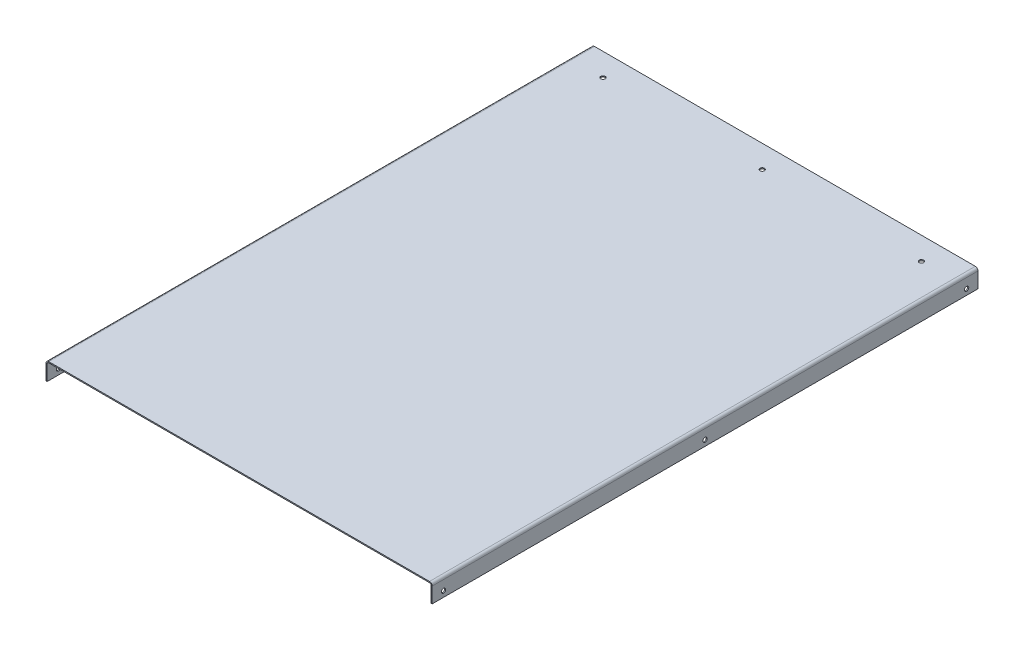
ISO-10303-21;
HEADER;
FILE_DESCRIPTION(('STEP AP214'),'2;1');
FILE_NAME('part.step','',(''),(''),'','','');
FILE_SCHEMA(('AUTOMOTIVE_DESIGN { 1 0 10303 214 1 1 1 1 }'));
ENDSEC;
DATA;
#1=APPLICATION_CONTEXT('core data for automotive mechanical design processes');
#2=APPLICATION_PROTOCOL_DEFINITION('international standard','automotive_design',2000,#1);
#3=PRODUCT_CONTEXT('',#1,'mechanical');
#4=PRODUCT('Part','Part','',(#3));
#5=PRODUCT_RELATED_PRODUCT_CATEGORY('part','',(#4));
#6=PRODUCT_DEFINITION_FORMATION('','',#4);
#7=PRODUCT_DEFINITION_CONTEXT('part definition',#1,'design');
#8=PRODUCT_DEFINITION('design','',#6,#7);
#9=PRODUCT_DEFINITION_SHAPE('','',#8);
#10=(LENGTH_UNIT() NAMED_UNIT(*) SI_UNIT(.MILLI.,.METRE.));
#11=(NAMED_UNIT(*) PLANE_ANGLE_UNIT() SI_UNIT($,.RADIAN.));
#12=(NAMED_UNIT(*) SI_UNIT($,.STERADIAN.) SOLID_ANGLE_UNIT());
#13=UNCERTAINTY_MEASURE_WITH_UNIT(LENGTH_MEASURE(1.E-05),#10,'distance_accuracy_value','');
#14=(GEOMETRIC_REPRESENTATION_CONTEXT(3) GLOBAL_UNCERTAINTY_ASSIGNED_CONTEXT((#13)) GLOBAL_UNIT_ASSIGNED_CONTEXT((#10,
#11,#12)) REPRESENTATION_CONTEXT('',''));
#15=CARTESIAN_POINT('',(0.,0.,0.));
#16=DIRECTION('',(0.,0.,1.));
#17=DIRECTION('',(1.,0.,0.));
#18=AXIS2_PLACEMENT_3D('',#15,#16,#17);
#19=CARTESIAN_POINT('',(1.778,19.05,-609.6));
#20=DIRECTION('',(0.,0.,-1.));
#21=DIRECTION('',(-1.,0.,0.));
#22=AXIS2_PLACEMENT_3D('',#19,#20,#21);
#23=PLANE('',#22);
#24=DIRECTION('',(0.,1.,0.));
#25=VECTOR('',#24,1.);
#26=CARTESIAN_POINT('',(1.778,19.05,-609.6));
#27=LINE('',#26,#25);
#28=CARTESIAN_POINT('',(1.778,19.05,-609.6));
#29=VERTEX_POINT('',#28);
#30=CARTESIAN_POINT('',(1.778,20.2692,-609.6));
#31=VERTEX_POINT('',#30);
#32=EDGE_CURVE('E11',#29,#31,#27,.T.);
#33=ORIENTED_EDGE('',*,*,#32,.F.);
#34=CARTESIAN_POINT('',(1.778,17.272,-609.6));
#35=DIRECTION('',(0.,0.,1.));
#36=DIRECTION('',(1.,0.,0.));
#37=AXIS2_PLACEMENT_3D('',#34,#35,#36);
#38=CIRCLE('',#37,1.778);
#39=CARTESIAN_POINT('',(0.,17.272,-609.6));
#40=VERTEX_POINT('',#39);
#41=EDGE_CURVE('E199',#40,#29,#38,.F.);
#42=ORIENTED_EDGE('',*,*,#41,.F.);
#43=DIRECTION('',(1.,0.,0.));
#44=VECTOR('',#43,1.);
#45=CARTESIAN_POINT('',(-1.2192,17.272,-609.6));
#46=LINE('',#45,#44);
#47=CARTESIAN_POINT('',(-1.2192,17.272,-609.6));
#48=VERTEX_POINT('',#47);
#49=EDGE_CURVE('E38',#48,#40,#46,.T.);
#50=ORIENTED_EDGE('',*,*,#49,.F.);
#51=CARTESIAN_POINT('',(1.778,17.272,-609.6));
#52=DIRECTION('',(0.,0.,1.));
#53=DIRECTION('',(1.,0.,0.));
#54=AXIS2_PLACEMENT_3D('',#51,#52,#53);
#55=CIRCLE('',#54,2.9972);
#56=EDGE_CURVE('E188',#48,#31,#55,.F.);
#57=ORIENTED_EDGE('',*,*,#56,.T.);
#58=EDGE_LOOP('',(#33,#42,#50,#57));
#59=FACE_BOUND('',#58,.T.);
#60=ADVANCED_FACE('F31',(#59),#23,.T.);
#61=CARTESIAN_POINT('',(-1.2192,17.272,-609.6));
#62=DIRECTION('',(0.,0.,-1.));
#63=DIRECTION('',(-1.,0.,0.));
#64=AXIS2_PLACEMENT_3D('',#61,#62,#63);
#65=PLANE('',#64);
#66=DIRECTION('',(1.,0.,0.));
#67=VECTOR('',#66,1.);
#68=CARTESIAN_POINT('',(0.,19.05,-609.6));
#69=LINE('',#68,#67);
#70=CARTESIAN_POINT('',(427.0756,19.05,-609.6));
#71=VERTEX_POINT('',#70);
#72=EDGE_CURVE('E202',#29,#71,#69,.T.);
#73=ORIENTED_EDGE('',*,*,#72,.F.);
#74=ORIENTED_EDGE('',*,*,#32,.T.);
#75=DIRECTION('',(1.,0.,0.));
#76=VECTOR('',#75,1.);
#77=CARTESIAN_POINT('',(0.,20.2692,-609.6));
#78=LINE('',#77,#76);
#79=CARTESIAN_POINT('',(427.0756,20.2692,-609.6));
#80=VERTEX_POINT('',#79);
#81=EDGE_CURVE('E186',#31,#80,#78,.T.);
#82=ORIENTED_EDGE('',*,*,#81,.T.);
#83=DIRECTION('',(1.36592399683213E-13,-1.,0.));
#84=VECTOR('',#83,1.);
#85=CARTESIAN_POINT('',(427.0756,20.2692,-609.6));
#86=LINE('',#85,#84);
#87=EDGE_CURVE('E53',#80,#71,#86,.T.);
#88=ORIENTED_EDGE('',*,*,#87,.T.);
#89=EDGE_LOOP('',(#73,#74,#82,#88));
#90=FACE_BOUND('',#89,.T.);
#91=ADVANCED_FACE('F278',(#90),#65,.T.);
#92=CARTESIAN_POINT('',(0.,17.272,0.));
#93=DIRECTION('',(0.,0.,1.));
#94=DIRECTION('',(1.,0.,0.));
#95=AXIS2_PLACEMENT_3D('',#92,#93,#94);
#96=PLANE('',#95);
#97=DIRECTION('',(-1.,0.,0.));
#98=VECTOR('',#97,1.);
#99=CARTESIAN_POINT('',(0.,17.272,0.));
#100=LINE('',#99,#98);
#101=CARTESIAN_POINT('',(0.,17.272,0.));
#102=VERTEX_POINT('',#101);
#103=CARTESIAN_POINT('',(-1.2192,17.272,0.));
#104=VERTEX_POINT('',#103);
#105=EDGE_CURVE('E243',#102,#104,#100,.T.);
#106=ORIENTED_EDGE('',*,*,#105,.F.);
#107=CARTESIAN_POINT('',(1.778,17.272,0.));
#108=DIRECTION('',(0.,0.,1.));
#109=DIRECTION('',(1.,0.,0.));
#110=AXIS2_PLACEMENT_3D('',#107,#108,#109);
#111=CIRCLE('',#110,1.778);
#112=CARTESIAN_POINT('',(1.778,19.05,0.));
#113=VERTEX_POINT('',#112);
#114=EDGE_CURVE('E171',#102,#113,#111,.F.);
#115=ORIENTED_EDGE('',*,*,#114,.T.);
#116=DIRECTION('',(0.,-1.,0.));
#117=VECTOR('',#116,1.);
#118=CARTESIAN_POINT('',(1.778,20.2692,0.));
#119=LINE('',#118,#117);
#120=CARTESIAN_POINT('',(1.778,20.2692,0.));
#121=VERTEX_POINT('',#120);
#122=EDGE_CURVE('E241',#121,#113,#119,.T.);
#123=ORIENTED_EDGE('',*,*,#122,.F.);
#124=CARTESIAN_POINT('',(1.778,17.272,0.));
#125=DIRECTION('',(0.,0.,1.));
#126=DIRECTION('',(1.,0.,0.));
#127=AXIS2_PLACEMENT_3D('',#124,#125,#126);
#128=CIRCLE('',#127,2.9972);
#129=EDGE_CURVE('E160',#104,#121,#128,.F.);
#130=ORIENTED_EDGE('',*,*,#129,.F.);
#131=EDGE_LOOP('',(#106,#115,#123,#130));
#132=FACE_BOUND('',#131,.T.);
#133=ADVANCED_FACE('F312',(#132),#96,.T.);
#134=CARTESIAN_POINT('',(1.778,20.2692,0.));
#135=DIRECTION('',(0.,0.,1.));
#136=DIRECTION('',(1.,0.,0.));
#137=AXIS2_PLACEMENT_3D('',#134,#135,#136);
#138=PLANE('',#137);
#139=DIRECTION('',(0.,1.,0.));
#140=VECTOR('',#139,1.);
#141=CARTESIAN_POINT('',(0.,0.,0.));
#142=LINE('',#141,#140);
#143=CARTESIAN_POINT('',(0.,0.,0.));
#144=VERTEX_POINT('',#143);
#145=EDGE_CURVE('E168',#144,#102,#142,.T.);
#146=ORIENTED_EDGE('',*,*,#145,.T.);
#147=ORIENTED_EDGE('',*,*,#105,.T.);
#148=DIRECTION('',(0.,1.,0.));
#149=VECTOR('',#148,1.);
#150=CARTESIAN_POINT('',(-1.2192,0.,0.));
#151=LINE('',#150,#149);
#152=CARTESIAN_POINT('',(-1.2192,0.,0.));
#153=VERTEX_POINT('',#152);
#154=EDGE_CURVE('E163',#153,#104,#151,.T.);
#155=ORIENTED_EDGE('',*,*,#154,.F.);
#156=DIRECTION('',(-1.,0.,0.));
#157=VECTOR('',#156,1.);
#158=CARTESIAN_POINT('',(0.,0.,0.));
#159=LINE('',#158,#157);
#160=EDGE_CURVE('E166',#144,#153,#159,.T.);
#161=ORIENTED_EDGE('',*,*,#160,.F.);
#162=EDGE_LOOP('',(#146,#147,#155,#161));
#163=FACE_BOUND('',#162,.T.);
#164=ADVANCED_FACE('F306',(#163),#138,.T.);
#165=CARTESIAN_POINT('',(428.8536,17.272,-609.6));
#166=DIRECTION('',(0.,0.,-1.));
#167=DIRECTION('',(-1.,0.,0.));
#168=AXIS2_PLACEMENT_3D('',#165,#166,#167);
#169=PLANE('',#168);
#170=DIRECTION('',(1.,0.,0.));
#171=VECTOR('',#170,1.);
#172=CARTESIAN_POINT('',(428.8536,17.272,-609.6));
#173=LINE('',#172,#171);
#174=CARTESIAN_POINT('',(428.8536,17.272,-609.6));
#175=VERTEX_POINT('',#174);
#176=CARTESIAN_POINT('',(430.0728,17.272,-609.6));
#177=VERTEX_POINT('',#176);
#178=EDGE_CURVE('E45',#175,#177,#173,.T.);
#179=ORIENTED_EDGE('',*,*,#178,.F.);
#180=CARTESIAN_POINT('',(427.0756,17.272,-609.6));
#181=DIRECTION('',(0.,0.,1.));
#182=DIRECTION('',(1.,0.,0.));
#183=AXIS2_PLACEMENT_3D('',#180,#181,#182);
#184=CIRCLE('',#183,1.778);
#185=EDGE_CURVE('E132',#71,#175,#184,.F.);
#186=ORIENTED_EDGE('',*,*,#185,.F.);
#187=ORIENTED_EDGE('',*,*,#87,.F.);
#188=CARTESIAN_POINT('',(427.0756,17.272,-609.6));
#189=DIRECTION('',(0.,0.,1.));
#190=DIRECTION('',(1.,0.,0.));
#191=AXIS2_PLACEMENT_3D('',#188,#189,#190);
#192=CIRCLE('',#191,2.9972);
#193=EDGE_CURVE('E184',#80,#177,#192,.F.);
#194=ORIENTED_EDGE('',*,*,#193,.T.);
#195=EDGE_LOOP('',(#179,#186,#187,#194));
#196=FACE_BOUND('',#195,.T.);
#197=ADVANCED_FACE('F282',(#196),#169,.T.);
#198=CARTESIAN_POINT('',(427.0756,20.2692,-609.6));
#199=DIRECTION('',(0.,0.,-1.));
#200=DIRECTION('',(-1.,0.,0.));
#201=AXIS2_PLACEMENT_3D('',#198,#199,#200);
#202=PLANE('',#201);
#203=DIRECTION('',(0.,-1.,0.));
#204=VECTOR('',#203,1.);
#205=CARTESIAN_POINT('',(428.8536,19.05,-609.6));
#206=LINE('',#205,#204);
#207=CARTESIAN_POINT('',(428.8536,0.,-609.6));
#208=VERTEX_POINT('',#207);
#209=EDGE_CURVE('E128',#175,#208,#206,.T.);
#210=ORIENTED_EDGE('',*,*,#209,.F.);
#211=ORIENTED_EDGE('',*,*,#178,.T.);
#212=DIRECTION('',(0.,1.,0.));
#213=VECTOR('',#212,1.);
#214=CARTESIAN_POINT('',(430.0728,19.05,-609.6));
#215=LINE('',#214,#213);
#216=CARTESIAN_POINT('',(430.0728,0.,-609.6));
#217=VERTEX_POINT('',#216);
#218=EDGE_CURVE('E182',#177,#217,#215,.F.);
#219=ORIENTED_EDGE('',*,*,#218,.T.);
#220=DIRECTION('',(-1.,0.,0.));
#221=VECTOR('',#220,1.);
#222=CARTESIAN_POINT('',(430.0728,0.,-609.6));
#223=LINE('',#222,#221);
#224=EDGE_CURVE('E180',#217,#208,#223,.T.);
#225=ORIENTED_EDGE('',*,*,#224,.T.);
#226=EDGE_LOOP('',(#210,#211,#219,#225));
#227=FACE_BOUND('',#226,.T.);
#228=ADVANCED_FACE('F298',(#227),#202,.T.);
#229=CARTESIAN_POINT('',(427.0756,19.05,0.));
#230=DIRECTION('',(0.,0.,1.));
#231=DIRECTION('',(1.,0.,0.));
#232=AXIS2_PLACEMENT_3D('',#229,#230,#231);
#233=PLANE('',#232);
#234=DIRECTION('',(-1.36592399683213E-13,1.,0.));
#235=VECTOR('',#234,1.);
#236=CARTESIAN_POINT('',(427.0756,19.05,0.));
#237=LINE('',#236,#235);
#238=CARTESIAN_POINT('',(427.0756,19.05,0.));
#239=VERTEX_POINT('',#238);
#240=CARTESIAN_POINT('',(427.0756,20.2692,0.));
#241=VERTEX_POINT('',#240);
#242=EDGE_CURVE('E237',#239,#241,#237,.T.);
#243=ORIENTED_EDGE('',*,*,#242,.F.);
#244=CARTESIAN_POINT('',(427.0756,17.272,0.));
#245=DIRECTION('',(0.,0.,1.));
#246=DIRECTION('',(1.,0.,0.));
#247=AXIS2_PLACEMENT_3D('',#244,#245,#246);
#248=CIRCLE('',#247,1.778);
#249=CARTESIAN_POINT('',(428.8536,17.272,0.));
#250=VERTEX_POINT('',#249);
#251=EDGE_CURVE('E177',#239,#250,#248,.F.);
#252=ORIENTED_EDGE('',*,*,#251,.T.);
#253=DIRECTION('',(-1.,0.,0.));
#254=VECTOR('',#253,1.);
#255=CARTESIAN_POINT('',(430.0728,17.272,0.));
#256=LINE('',#255,#254);
#257=CARTESIAN_POINT('',(430.0728,17.272,0.));
#258=VERTEX_POINT('',#257);
#259=EDGE_CURVE('E144',#258,#250,#256,.T.);
#260=ORIENTED_EDGE('',*,*,#259,.F.);
#261=CARTESIAN_POINT('',(427.0756,17.272,0.));
#262=DIRECTION('',(0.,0.,1.));
#263=DIRECTION('',(1.,0.,0.));
#264=AXIS2_PLACEMENT_3D('',#261,#262,#263);
#265=CIRCLE('',#264,2.9972);
#266=EDGE_CURVE('E154',#241,#258,#265,.F.);
#267=ORIENTED_EDGE('',*,*,#266,.F.);
#268=EDGE_LOOP('',(#243,#252,#260,#267));
#269=FACE_BOUND('',#268,.T.);
#270=ADVANCED_FACE('F287',(#269),#233,.T.);
#271=CARTESIAN_POINT('',(430.0728,17.272,0.));
#272=DIRECTION('',(0.,0.,1.));
#273=DIRECTION('',(1.,0.,0.));
#274=AXIS2_PLACEMENT_3D('',#271,#272,#273);
#275=PLANE('',#274);
#276=DIRECTION('',(1.,0.,0.));
#277=VECTOR('',#276,1.);
#278=CARTESIAN_POINT('',(0.,19.05,0.));
#279=LINE('',#278,#277);
#280=EDGE_CURVE('E174',#113,#239,#279,.T.);
#281=ORIENTED_EDGE('',*,*,#280,.T.);
#282=ORIENTED_EDGE('',*,*,#242,.T.);
#283=DIRECTION('',(1.,0.,0.));
#284=VECTOR('',#283,1.);
#285=CARTESIAN_POINT('',(0.,20.2692,0.));
#286=LINE('',#285,#284);
#287=EDGE_CURVE('E157',#121,#241,#286,.T.);
#288=ORIENTED_EDGE('',*,*,#287,.F.);
#289=ORIENTED_EDGE('',*,*,#122,.T.);
#290=EDGE_LOOP('',(#281,#282,#288,#289));
#291=FACE_BOUND('',#290,.T.);
#292=ADVANCED_FACE('F290',(#291),#275,.T.);
#293=CARTESIAN_POINT('',(428.8536,19.05,-609.6));
#294=DIRECTION('',(-1.,0.,0.));
#295=DIRECTION('',(0.,0.,1.));
#296=AXIS2_PLACEMENT_3D('',#293,#294,#295);
#297=PLANE('',#296);
#298=CARTESIAN_POINT('',(428.8536,6.35,-596.9));
#299=DIRECTION('',(-1.,0.,0.));
#300=DIRECTION('',(0.,0.,1.));
#301=AXIS2_PLACEMENT_3D('',#298,#299,#300);
#302=CIRCLE('',#301,2.38760000000005);
#303=CARTESIAN_POINT('',(428.8536,6.35,-594.5124));
#304=VERTEX_POINT('',#303);
#305=EDGE_CURVE('E641',#304,#304,#302,.T.);
#306=ORIENTED_EDGE('',*,*,#305,.F.);
#307=EDGE_LOOP('',(#306));
#308=FACE_BOUND('',#307,.T.);
#309=CARTESIAN_POINT('',(428.8536,6.35,-304.8));
#310=DIRECTION('',(-1.,0.,0.));
#311=DIRECTION('',(0.,0.,1.));
#312=AXIS2_PLACEMENT_3D('',#309,#310,#311);
#313=CIRCLE('',#312,2.38759999999999);
#314=CARTESIAN_POINT('',(428.8536,6.35,-302.4124));
#315=VERTEX_POINT('',#314);
#316=EDGE_CURVE('E657',#315,#315,#313,.T.);
#317=ORIENTED_EDGE('',*,*,#316,.F.);
#318=EDGE_LOOP('',(#317));
#319=FACE_BOUND('',#318,.T.);
#320=CARTESIAN_POINT('',(428.8536,6.35000000000001,-12.7));
#321=DIRECTION('',(-1.,0.,0.));
#322=DIRECTION('',(0.,0.,1.));
#323=AXIS2_PLACEMENT_3D('',#320,#321,#322);
#324=CIRCLE('',#323,2.3876);
#325=CARTESIAN_POINT('',(428.8536,6.35000000000001,-10.3124));
#326=VERTEX_POINT('',#325);
#327=EDGE_CURVE('E669',#326,#326,#324,.T.);
#328=ORIENTED_EDGE('',*,*,#327,.F.);
#329=EDGE_LOOP('',(#328));
#330=FACE_BOUND('',#329,.T.);
#331=DIRECTION('',(0.,-1.,0.));
#332=VECTOR('',#331,1.);
#333=CARTESIAN_POINT('',(428.8536,19.05,0.));
#334=LINE('',#333,#332);
#335=CARTESIAN_POINT('',(428.8536,0.,0.));
#336=VERTEX_POINT('',#335);
#337=EDGE_CURVE('E125',#250,#336,#334,.T.);
#338=ORIENTED_EDGE('',*,*,#337,.F.);
#339=DIRECTION('',(0.,0.,1.));
#340=VECTOR('',#339,1.);
#341=CARTESIAN_POINT('',(428.8536,17.272,-609.6));
#342=LINE('',#341,#340);
#343=EDGE_CURVE('E207',#175,#250,#342,.T.);
#344=ORIENTED_EDGE('',*,*,#343,.F.);
#345=ORIENTED_EDGE('',*,*,#209,.T.);
#346=DIRECTION('',(0.,0.,1.));
#347=VECTOR('',#346,1.);
#348=CARTESIAN_POINT('',(428.8536,0.,-609.6));
#349=LINE('',#348,#347);
#350=EDGE_CURVE('E121',#208,#336,#349,.T.);
#351=ORIENTED_EDGE('',*,*,#350,.T.);
#352=EDGE_LOOP('',(#338,#344,#345,#351));
#353=FACE_BOUND('',#352,.T.);
#354=ADVANCED_FACE('F123',(#308,#319,#330,#353),#297,.T.);
#355=CARTESIAN_POINT('',(427.0756,17.272,-609.6));
#356=DIRECTION('',(0.,0.,1.));
#357=DIRECTION('',(1.,0.,0.));
#358=AXIS2_PLACEMENT_3D('',#355,#356,#357);
#359=CYLINDRICAL_SURFACE('',#358,1.778);
#360=ORIENTED_EDGE('',*,*,#251,.F.);
#361=DIRECTION('',(0.,0.,1.));
#362=VECTOR('',#361,1.);
#363=CARTESIAN_POINT('',(427.0756,19.05,-609.6));
#364=LINE('',#363,#362);
#365=EDGE_CURVE('E209',#71,#239,#364,.T.);
#366=ORIENTED_EDGE('',*,*,#365,.F.);
#367=ORIENTED_EDGE('',*,*,#185,.T.);
#368=ORIENTED_EDGE('',*,*,#343,.T.);
#369=EDGE_LOOP('',(#360,#366,#367,#368));
#370=FACE_BOUND('',#369,.T.);
#371=ADVANCED_FACE('F285',(#370),#359,.F.);
#372=CARTESIAN_POINT('',(0.,19.05,-609.6));
#373=DIRECTION('',(0.,-1.,0.));
#374=DIRECTION('',(0.,0.,-1.));
#375=AXIS2_PLACEMENT_3D('',#372,#373,#374);
#376=PLANE('',#375);
#377=CARTESIAN_POINT('',(392.2268,19.05,-584.2254));
#378=DIRECTION('',(0.,1.,0.));
#379=DIRECTION('',(0.,0.,1.));
#380=AXIS2_PLACEMENT_3D('',#377,#378,#379);
#381=CIRCLE('',#380,2.47649999999997);
#382=CARTESIAN_POINT('',(392.2268,19.05,-581.7489));
#383=VERTEX_POINT('',#382);
#384=EDGE_CURVE('E675',#383,#383,#381,.T.);
#385=ORIENTED_EDGE('',*,*,#384,.T.);
#386=EDGE_LOOP('',(#385));
#387=FACE_BOUND('',#386,.T.);
#388=CARTESIAN_POINT('',(214.4268,19.05,-584.2254));
#389=DIRECTION('',(0.,1.,0.));
#390=DIRECTION('',(0.,0.,1.));
#391=AXIS2_PLACEMENT_3D('',#388,#389,#390);
#392=CIRCLE('',#391,2.4765);
#393=CARTESIAN_POINT('',(214.4268,19.05,-581.7489));
#394=VERTEX_POINT('',#393);
#395=EDGE_CURVE('E681',#394,#394,#392,.T.);
#396=ORIENTED_EDGE('',*,*,#395,.T.);
#397=EDGE_LOOP('',(#396));
#398=FACE_BOUND('',#397,.T.);
#399=CARTESIAN_POINT('',(36.6267999999998,19.05,-584.2254));
#400=DIRECTION('',(0.,1.,0.));
#401=DIRECTION('',(0.,0.,1.));
#402=AXIS2_PLACEMENT_3D('',#399,#400,#401);
#403=CIRCLE('',#402,2.4765);
#404=CARTESIAN_POINT('',(36.6267999999998,19.05,-581.7489));
#405=VERTEX_POINT('',#404);
#406=EDGE_CURVE('E146',#405,#405,#403,.T.);
#407=ORIENTED_EDGE('',*,*,#406,.T.);
#408=EDGE_LOOP('',(#407));
#409=FACE_BOUND('',#408,.T.);
#410=ORIENTED_EDGE('',*,*,#280,.F.);
#411=DIRECTION('',(0.,0.,1.));
#412=VECTOR('',#411,1.);
#413=CARTESIAN_POINT('',(1.778,19.05,-609.6));
#414=LINE('',#413,#412);
#415=EDGE_CURVE('E212',#29,#113,#414,.T.);
#416=ORIENTED_EDGE('',*,*,#415,.F.);
#417=ORIENTED_EDGE('',*,*,#72,.T.);
#418=ORIENTED_EDGE('',*,*,#365,.T.);
#419=EDGE_LOOP('',(#410,#416,#417,#418));
#420=FACE_BOUND('',#419,.T.);
#421=ADVANCED_FACE('F281',(#387,#398,#409,#420),#376,.T.);
#422=CARTESIAN_POINT('',(1.778,17.272,-609.6));
#423=DIRECTION('',(0.,0.,1.));
#424=DIRECTION('',(1.,0.,0.));
#425=AXIS2_PLACEMENT_3D('',#422,#423,#424);
#426=CYLINDRICAL_SURFACE('',#425,1.778);
#427=ORIENTED_EDGE('',*,*,#114,.F.);
#428=DIRECTION('',(0.,0.,1.));
#429=VECTOR('',#428,1.);
#430=CARTESIAN_POINT('',(0.,17.272,-609.6));
#431=LINE('',#430,#429);
#432=EDGE_CURVE('E215',#40,#102,#431,.T.);
#433=ORIENTED_EDGE('',*,*,#432,.F.);
#434=ORIENTED_EDGE('',*,*,#41,.T.);
#435=ORIENTED_EDGE('',*,*,#415,.T.);
#436=EDGE_LOOP('',(#427,#433,#434,#435));
#437=FACE_BOUND('',#436,.T.);
#438=ADVANCED_FACE('F254',(#437),#426,.F.);
#439=CARTESIAN_POINT('',(0.,0.,-609.6));
#440=DIRECTION('',(1.,0.,0.));
#441=DIRECTION('',(0.,0.,-1.));
#442=AXIS2_PLACEMENT_3D('',#439,#440,#441);
#443=PLANE('',#442);
#444=CARTESIAN_POINT('',(0.,6.35,-596.9));
#445=DIRECTION('',(1.,0.,0.));
#446=DIRECTION('',(0.,0.,-1.));
#447=AXIS2_PLACEMENT_3D('',#444,#445,#446);
#448=CIRCLE('',#447,2.38760000000005);
#449=CARTESIAN_POINT('',(0.,6.35,-599.2876));
#450=VERTEX_POINT('',#449);
#451=EDGE_CURVE('E635',#450,#450,#448,.T.);
#452=ORIENTED_EDGE('',*,*,#451,.F.);
#453=EDGE_LOOP('',(#452));
#454=FACE_BOUND('',#453,.T.);
#455=CARTESIAN_POINT('',(0.,6.35,-304.8));
#456=DIRECTION('',(1.,0.,0.));
#457=DIRECTION('',(0.,0.,-1.));
#458=AXIS2_PLACEMENT_3D('',#455,#456,#457);
#459=CIRCLE('',#458,2.38759999999999);
#460=CARTESIAN_POINT('',(0.,6.35,-307.1876));
#461=VERTEX_POINT('',#460);
#462=EDGE_CURVE('E654',#461,#461,#459,.T.);
#463=ORIENTED_EDGE('',*,*,#462,.F.);
#464=EDGE_LOOP('',(#463));
#465=FACE_BOUND('',#464,.T.);
#466=CARTESIAN_POINT('',(0.,6.35000000000001,-12.7));
#467=DIRECTION('',(1.,0.,0.));
#468=DIRECTION('',(0.,0.,-1.));
#469=AXIS2_PLACEMENT_3D('',#466,#467,#468);
#470=CIRCLE('',#469,2.3876);
#471=CARTESIAN_POINT('',(0.,6.35000000000001,-15.0876));
#472=VERTEX_POINT('',#471);
#473=EDGE_CURVE('E666',#472,#472,#470,.T.);
#474=ORIENTED_EDGE('',*,*,#473,.F.);
#475=EDGE_LOOP('',(#474));
#476=FACE_BOUND('',#475,.T.);
#477=ORIENTED_EDGE('',*,*,#145,.F.);
#478=DIRECTION('',(0.,0.,1.));
#479=VECTOR('',#478,1.);
#480=CARTESIAN_POINT('',(0.,0.,-609.6));
#481=LINE('',#480,#479);
#482=CARTESIAN_POINT('',(0.,0.,-609.6));
#483=VERTEX_POINT('',#482);
#484=EDGE_CURVE('E218',#483,#144,#481,.T.);
#485=ORIENTED_EDGE('',*,*,#484,.F.);
#486=DIRECTION('',(0.,1.,0.));
#487=VECTOR('',#486,1.);
#488=CARTESIAN_POINT('',(0.,0.,-609.6));
#489=LINE('',#488,#487);
#490=EDGE_CURVE('E196',#483,#40,#489,.T.);
#491=ORIENTED_EDGE('',*,*,#490,.T.);
#492=ORIENTED_EDGE('',*,*,#432,.T.);
#493=EDGE_LOOP('',(#477,#485,#491,#492));
#494=FACE_BOUND('',#493,.T.);
#495=ADVANCED_FACE('F258',(#454,#465,#476,#494),#443,.T.);
#496=CARTESIAN_POINT('',(0.,0.,-609.6));
#497=DIRECTION('',(0.,1.,0.));
#498=DIRECTION('',(0.,0.,1.));
#499=AXIS2_PLACEMENT_3D('',#496,#497,#498);
#500=PLANE('',#499);
#501=ORIENTED_EDGE('',*,*,#160,.T.);
#502=DIRECTION('',(0.,0.,1.));
#503=VECTOR('',#502,1.);
#504=CARTESIAN_POINT('',(-1.2192,0.,-609.6));
#505=LINE('',#504,#503);
#506=CARTESIAN_POINT('',(-1.2192,0.,-609.6));
#507=VERTEX_POINT('',#506);
#508=EDGE_CURVE('E220',#507,#153,#505,.T.);
#509=ORIENTED_EDGE('',*,*,#508,.F.);
#510=DIRECTION('',(-1.,0.,0.));
#511=VECTOR('',#510,1.);
#512=CARTESIAN_POINT('',(0.,0.,-609.6));
#513=LINE('',#512,#511);
#514=EDGE_CURVE('E194',#483,#507,#513,.T.);
#515=ORIENTED_EDGE('',*,*,#514,.F.);
#516=ORIENTED_EDGE('',*,*,#484,.T.);
#517=EDGE_LOOP('',(#501,#509,#515,#516));
#518=FACE_BOUND('',#517,.T.);
#519=ADVANCED_FACE('F263',(#518),#500,.F.);
#520=CARTESIAN_POINT('',(-1.2192,0.,-609.6));
#521=DIRECTION('',(1.,0.,0.));
#522=DIRECTION('',(0.,0.,-1.));
#523=AXIS2_PLACEMENT_3D('',#520,#521,#522);
#524=PLANE('',#523);
#525=CARTESIAN_POINT('',(-1.21919999999998,6.35,-596.9));
#526=DIRECTION('',(1.,0.,0.));
#527=DIRECTION('',(0.,0.,-1.));
#528=AXIS2_PLACEMENT_3D('',#525,#526,#527);
#529=CIRCLE('',#528,2.38760000000005);
#530=CARTESIAN_POINT('',(-1.21919999999998,6.35,-599.2876));
#531=VERTEX_POINT('',#530);
#532=EDGE_CURVE('E638',#531,#531,#529,.T.);
#533=ORIENTED_EDGE('',*,*,#532,.T.);
#534=EDGE_LOOP('',(#533));
#535=FACE_BOUND('',#534,.T.);
#536=CARTESIAN_POINT('',(-1.21919999999998,6.35,-304.8));
#537=DIRECTION('',(1.,0.,0.));
#538=DIRECTION('',(0.,0.,-1.));
#539=AXIS2_PLACEMENT_3D('',#536,#537,#538);
#540=CIRCLE('',#539,2.38759999999999);
#541=CARTESIAN_POINT('',(-1.21919999999998,6.35,-307.1876));
#542=VERTEX_POINT('',#541);
#543=EDGE_CURVE('E651',#542,#542,#540,.T.);
#544=ORIENTED_EDGE('',*,*,#543,.T.);
#545=EDGE_LOOP('',(#544));
#546=FACE_BOUND('',#545,.T.);
#547=CARTESIAN_POINT('',(-1.21919999999998,6.35000000000001,-12.7));
#548=DIRECTION('',(1.,0.,0.));
#549=DIRECTION('',(0.,0.,-1.));
#550=AXIS2_PLACEMENT_3D('',#547,#548,#549);
#551=CIRCLE('',#550,2.3876);
#552=CARTESIAN_POINT('',(-1.21919999999998,6.35000000000001,-15.0876));
#553=VERTEX_POINT('',#552);
#554=EDGE_CURVE('E663',#553,#553,#551,.T.);
#555=ORIENTED_EDGE('',*,*,#554,.T.);
#556=EDGE_LOOP('',(#555));
#557=FACE_BOUND('',#556,.T.);
#558=ORIENTED_EDGE('',*,*,#154,.T.);
#559=DIRECTION('',(0.,0.,1.));
#560=VECTOR('',#559,1.);
#561=CARTESIAN_POINT('',(-1.2192,17.272,-609.6));
#562=LINE('',#561,#560);
#563=EDGE_CURVE('E223',#48,#104,#562,.T.);
#564=ORIENTED_EDGE('',*,*,#563,.F.);
#565=DIRECTION('',(0.,1.,0.));
#566=VECTOR('',#565,1.);
#567=CARTESIAN_POINT('',(-1.2192,0.,-609.6));
#568=LINE('',#567,#566);
#569=EDGE_CURVE('E191',#507,#48,#568,.T.);
#570=ORIENTED_EDGE('',*,*,#569,.F.);
#571=ORIENTED_EDGE('',*,*,#508,.T.);
#572=EDGE_LOOP('',(#558,#564,#570,#571));
#573=FACE_BOUND('',#572,.T.);
#574=ADVANCED_FACE('F266',(#535,#546,#557,#573),#524,.F.);
#575=CARTESIAN_POINT('',(1.778,17.272,-609.6));
#576=DIRECTION('',(0.,0.,1.));
#577=DIRECTION('',(1.,0.,0.));
#578=AXIS2_PLACEMENT_3D('',#575,#576,#577);
#579=CYLINDRICAL_SURFACE('',#578,2.9972);
#580=ORIENTED_EDGE('',*,*,#129,.T.);
#581=DIRECTION('',(0.,0.,1.));
#582=VECTOR('',#581,1.);
#583=CARTESIAN_POINT('',(1.778,20.2692,-609.6));
#584=LINE('',#583,#582);
#585=EDGE_CURVE('E226',#31,#121,#584,.T.);
#586=ORIENTED_EDGE('',*,*,#585,.F.);
#587=ORIENTED_EDGE('',*,*,#56,.F.);
#588=ORIENTED_EDGE('',*,*,#563,.T.);
#589=EDGE_LOOP('',(#580,#586,#587,#588));
#590=FACE_BOUND('',#589,.T.);
#591=ADVANCED_FACE('F271',(#590),#579,.T.);
#592=CARTESIAN_POINT('',(0.,20.2692,-609.6));
#593=DIRECTION('',(0.,-1.,0.));
#594=DIRECTION('',(0.,0.,-1.));
#595=AXIS2_PLACEMENT_3D('',#592,#593,#594);
#596=PLANE('',#595);
#597=CARTESIAN_POINT('',(392.2268,20.2692,-584.2254));
#598=DIRECTION('',(0.,1.,0.));
#599=DIRECTION('',(0.,0.,1.));
#600=AXIS2_PLACEMENT_3D('',#597,#598,#599);
#601=CIRCLE('',#600,2.47649999999997);
#602=CARTESIAN_POINT('',(392.2268,20.2692,-581.7489));
#603=VERTEX_POINT('',#602);
#604=EDGE_CURVE('E672',#603,#603,#601,.T.);
#605=ORIENTED_EDGE('',*,*,#604,.F.);
#606=EDGE_LOOP('',(#605));
#607=FACE_BOUND('',#606,.T.);
#608=CARTESIAN_POINT('',(214.4268,20.2692,-584.2254));
#609=DIRECTION('',(0.,1.,0.));
#610=DIRECTION('',(0.,0.,1.));
#611=AXIS2_PLACEMENT_3D('',#608,#609,#610);
#612=CIRCLE('',#611,2.4765);
#613=CARTESIAN_POINT('',(214.4268,20.2692,-581.7489));
#614=VERTEX_POINT('',#613);
#615=EDGE_CURVE('E678',#614,#614,#612,.T.);
#616=ORIENTED_EDGE('',*,*,#615,.F.);
#617=EDGE_LOOP('',(#616));
#618=FACE_BOUND('',#617,.T.);
#619=CARTESIAN_POINT('',(36.6267999999998,20.2692,-584.2254));
#620=DIRECTION('',(0.,1.,0.));
#621=DIRECTION('',(0.,0.,1.));
#622=AXIS2_PLACEMENT_3D('',#619,#620,#621);
#623=CIRCLE('',#622,2.4765);
#624=CARTESIAN_POINT('',(36.6267999999998,20.2692,-581.7489));
#625=VERTEX_POINT('',#624);
#626=EDGE_CURVE('E149',#625,#625,#623,.T.);
#627=ORIENTED_EDGE('',*,*,#626,.F.);
#628=EDGE_LOOP('',(#627));
#629=FACE_BOUND('',#628,.T.);
#630=ORIENTED_EDGE('',*,*,#287,.T.);
#631=DIRECTION('',(0.,0.,1.));
#632=VECTOR('',#631,1.);
#633=CARTESIAN_POINT('',(427.0756,20.2692,-609.6));
#634=LINE('',#633,#632);
#635=EDGE_CURVE('E229',#80,#241,#634,.T.);
#636=ORIENTED_EDGE('',*,*,#635,.F.);
#637=ORIENTED_EDGE('',*,*,#81,.F.);
#638=ORIENTED_EDGE('',*,*,#585,.T.);
#639=EDGE_LOOP('',(#630,#636,#637,#638));
#640=FACE_BOUND('',#639,.T.);
#641=ADVANCED_FACE('F276',(#607,#618,#629,#640),#596,.F.);
#642=CARTESIAN_POINT('',(427.0756,17.272,-609.6));
#643=DIRECTION('',(0.,0.,1.));
#644=DIRECTION('',(1.,0.,0.));
#645=AXIS2_PLACEMENT_3D('',#642,#643,#644);
#646=CYLINDRICAL_SURFACE('',#645,2.9972);
#647=ORIENTED_EDGE('',*,*,#266,.T.);
#648=DIRECTION('',(0.,0.,1.));
#649=VECTOR('',#648,1.);
#650=CARTESIAN_POINT('',(430.0728,17.272,-609.6));
#651=LINE('',#650,#649);
#652=EDGE_CURVE('E232',#177,#258,#651,.T.);
#653=ORIENTED_EDGE('',*,*,#652,.F.);
#654=ORIENTED_EDGE('',*,*,#193,.F.);
#655=ORIENTED_EDGE('',*,*,#635,.T.);
#656=EDGE_LOOP('',(#647,#653,#654,#655));
#657=FACE_BOUND('',#656,.T.);
#658=ADVANCED_FACE('F292',(#657),#646,.T.);
#659=CARTESIAN_POINT('',(430.0728,19.05,-609.6));
#660=DIRECTION('',(-1.,0.,0.));
#661=DIRECTION('',(0.,0.,1.));
#662=AXIS2_PLACEMENT_3D('',#659,#660,#661);
#663=PLANE('',#662);
#664=CARTESIAN_POINT('',(430.0728,6.35,-596.9));
#665=DIRECTION('',(1.,0.,0.));
#666=DIRECTION('',(0.,0.,-1.));
#667=AXIS2_PLACEMENT_3D('',#664,#665,#666);
#668=CIRCLE('',#667,2.38760000000005);
#669=CARTESIAN_POINT('',(430.0728,6.35,-599.2876));
#670=VERTEX_POINT('',#669);
#671=EDGE_CURVE('E639',#670,#670,#668,.T.);
#672=ORIENTED_EDGE('',*,*,#671,.F.);
#673=EDGE_LOOP('',(#672));
#674=FACE_BOUND('',#673,.T.);
#675=CARTESIAN_POINT('',(430.0728,6.35,-304.8));
#676=DIRECTION('',(1.,0.,0.));
#677=DIRECTION('',(0.,0.,-1.));
#678=AXIS2_PLACEMENT_3D('',#675,#676,#677);
#679=CIRCLE('',#678,2.38759999999999);
#680=CARTESIAN_POINT('',(430.0728,6.35,-307.1876));
#681=VERTEX_POINT('',#680);
#682=EDGE_CURVE('E648',#681,#681,#679,.T.);
#683=ORIENTED_EDGE('',*,*,#682,.F.);
#684=EDGE_LOOP('',(#683));
#685=FACE_BOUND('',#684,.T.);
#686=CARTESIAN_POINT('',(430.0728,6.35000000000001,-12.7));
#687=DIRECTION('',(1.,0.,0.));
#688=DIRECTION('',(0.,0.,-1.));
#689=AXIS2_PLACEMENT_3D('',#686,#687,#688);
#690=CIRCLE('',#689,2.3876);
#691=CARTESIAN_POINT('',(430.0728,6.35000000000001,-15.0876));
#692=VERTEX_POINT('',#691);
#693=EDGE_CURVE('E660',#692,#692,#690,.T.);
#694=ORIENTED_EDGE('',*,*,#693,.F.);
#695=EDGE_LOOP('',(#694));
#696=FACE_BOUND('',#695,.T.);
#697=DIRECTION('',(0.,1.,0.));
#698=VECTOR('',#697,1.);
#699=CARTESIAN_POINT('',(430.0728,19.05,0.));
#700=LINE('',#699,#698);
#701=CARTESIAN_POINT('',(430.0728,0.,0.));
#702=VERTEX_POINT('',#701);
#703=EDGE_CURVE('E141',#258,#702,#700,.F.);
#704=ORIENTED_EDGE('',*,*,#703,.T.);
#705=DIRECTION('',(0.,0.,1.));
#706=VECTOR('',#705,1.);
#707=CARTESIAN_POINT('',(430.0728,0.,-609.6));
#708=LINE('',#707,#706);
#709=EDGE_CURVE('E131',#217,#702,#708,.T.);
#710=ORIENTED_EDGE('',*,*,#709,.F.);
#711=ORIENTED_EDGE('',*,*,#218,.F.);
#712=ORIENTED_EDGE('',*,*,#652,.T.);
#713=EDGE_LOOP('',(#704,#710,#711,#712));
#714=FACE_BOUND('',#713,.T.);
#715=ADVANCED_FACE('F296',(#674,#685,#696,#714),#663,.F.);
#716=CARTESIAN_POINT('',(430.0728,0.,-609.6));
#717=DIRECTION('',(0.,1.,0.));
#718=DIRECTION('',(-1.,0.,0.));
#719=AXIS2_PLACEMENT_3D('',#716,#717,#718);
#720=PLANE('',#719);
#721=DIRECTION('',(-1.,0.,0.));
#722=VECTOR('',#721,1.);
#723=CARTESIAN_POINT('',(430.0728,0.,0.));
#724=LINE('',#723,#722);
#725=EDGE_CURVE('E136',#702,#336,#724,.T.);
#726=ORIENTED_EDGE('',*,*,#725,.T.);
#727=ORIENTED_EDGE('',*,*,#350,.F.);
#728=ORIENTED_EDGE('',*,*,#224,.F.);
#729=ORIENTED_EDGE('',*,*,#709,.T.);
#730=EDGE_LOOP('',(#726,#727,#728,#729));
#731=FACE_BOUND('',#730,.T.);
#732=ADVANCED_FACE('F137',(#731),#720,.F.);
#733=CARTESIAN_POINT('',(427.0756,17.272,-609.6));
#734=DIRECTION('',(0.,0.,1.));
#735=DIRECTION('',(1.,0.,0.));
#736=AXIS2_PLACEMENT_3D('',#733,#734,#735);
#737=PLANE('',#736);
#738=ORIENTED_EDGE('',*,*,#569,.T.);
#739=ORIENTED_EDGE('',*,*,#49,.T.);
#740=ORIENTED_EDGE('',*,*,#490,.F.);
#741=ORIENTED_EDGE('',*,*,#514,.T.);
#742=EDGE_LOOP('',(#738,#739,#740,#741));
#743=FACE_BOUND('',#742,.T.);
#744=ADVANCED_FACE('F247',(#743),#737,.F.);
#745=CARTESIAN_POINT('',(427.0756,17.272,0.));
#746=DIRECTION('',(0.,0.,1.));
#747=DIRECTION('',(1.,0.,0.));
#748=AXIS2_PLACEMENT_3D('',#745,#746,#747);
#749=PLANE('',#748);
#750=ORIENTED_EDGE('',*,*,#337,.T.);
#751=ORIENTED_EDGE('',*,*,#725,.F.);
#752=ORIENTED_EDGE('',*,*,#703,.F.);
#753=ORIENTED_EDGE('',*,*,#259,.T.);
#754=EDGE_LOOP('',(#750,#751,#752,#753));
#755=FACE_BOUND('',#754,.T.);
#756=ADVANCED_FACE('F143',(#755),#749,.T.);
#757=CARTESIAN_POINT('',(36.6267999999998,19.05,-584.2254));
#758=DIRECTION('',(0.,1.,0.));
#759=DIRECTION('',(0.,0.,1.));
#760=AXIS2_PLACEMENT_3D('',#757,#758,#759);
#761=CYLINDRICAL_SURFACE('',#760,2.4765);
#762=ORIENTED_EDGE('',*,*,#406,.F.);
#763=EDGE_LOOP('',(#762));
#764=FACE_BOUND('',#763,.T.);
#765=ORIENTED_EDGE('',*,*,#626,.T.);
#766=EDGE_LOOP('',(#765));
#767=FACE_BOUND('',#766,.T.);
#768=ADVANCED_FACE('F435',(#764,#767),#761,.F.);
#769=CARTESIAN_POINT('',(214.4268,19.05,-584.2254));
#770=DIRECTION('',(0.,1.,0.));
#771=DIRECTION('',(0.,0.,1.));
#772=AXIS2_PLACEMENT_3D('',#769,#770,#771);
#773=CYLINDRICAL_SURFACE('',#772,2.4765);
#774=ORIENTED_EDGE('',*,*,#395,.F.);
#775=EDGE_LOOP('',(#774));
#776=FACE_BOUND('',#775,.T.);
#777=ORIENTED_EDGE('',*,*,#615,.T.);
#778=EDGE_LOOP('',(#777));
#779=FACE_BOUND('',#778,.T.);
#780=ADVANCED_FACE('F461',(#776,#779),#773,.F.);
#781=CARTESIAN_POINT('',(392.2268,19.05,-584.2254));
#782=DIRECTION('',(0.,1.,0.));
#783=DIRECTION('',(0.,0.,1.));
#784=AXIS2_PLACEMENT_3D('',#781,#782,#783);
#785=CYLINDRICAL_SURFACE('',#784,2.47649999999997);
#786=ORIENTED_EDGE('',*,*,#384,.F.);
#787=EDGE_LOOP('',(#786));
#788=FACE_BOUND('',#787,.T.);
#789=ORIENTED_EDGE('',*,*,#604,.T.);
#790=EDGE_LOOP('',(#789));
#791=FACE_BOUND('',#790,.T.);
#792=ADVANCED_FACE('F472',(#788,#791),#785,.F.);
#793=CARTESIAN_POINT('',(-1.21919999999998,6.35000000000001,-12.7));
#794=DIRECTION('',(1.,0.,0.));
#795=DIRECTION('',(0.,0.,-1.));
#796=AXIS2_PLACEMENT_3D('',#793,#794,#795);
#797=CYLINDRICAL_SURFACE('',#796,2.3876);
#798=ORIENTED_EDGE('',*,*,#327,.T.);
#799=EDGE_LOOP('',(#798));
#800=FACE_BOUND('',#799,.T.);
#801=ORIENTED_EDGE('',*,*,#693,.T.);
#802=EDGE_LOOP('',(#801));
#803=FACE_BOUND('',#802,.T.);
#804=ADVANCED_FACE('F483',(#800,#803),#797,.F.);
#805=ORIENTED_EDGE('',*,*,#473,.T.);
#806=EDGE_LOOP('',(#805));
#807=FACE_BOUND('',#806,.T.);
#808=ORIENTED_EDGE('',*,*,#554,.F.);
#809=EDGE_LOOP('',(#808));
#810=FACE_BOUND('',#809,.T.);
#811=ADVANCED_FACE('F526',(#807,#810),#797,.F.);
#812=CARTESIAN_POINT('',(-1.21919999999998,6.35,-304.8));
#813=DIRECTION('',(1.,0.,0.));
#814=DIRECTION('',(0.,0.,-1.));
#815=AXIS2_PLACEMENT_3D('',#812,#813,#814);
#816=CYLINDRICAL_SURFACE('',#815,2.38759999999999);
#817=ORIENTED_EDGE('',*,*,#316,.T.);
#818=EDGE_LOOP('',(#817));
#819=FACE_BOUND('',#818,.T.);
#820=ORIENTED_EDGE('',*,*,#682,.T.);
#821=EDGE_LOOP('',(#820));
#822=FACE_BOUND('',#821,.T.);
#823=ADVANCED_FACE('F537',(#819,#822),#816,.F.);
#824=ORIENTED_EDGE('',*,*,#462,.T.);
#825=EDGE_LOOP('',(#824));
#826=FACE_BOUND('',#825,.T.);
#827=ORIENTED_EDGE('',*,*,#543,.F.);
#828=EDGE_LOOP('',(#827));
#829=FACE_BOUND('',#828,.T.);
#830=ADVANCED_FACE('F547',(#826,#829),#816,.F.);
#831=CARTESIAN_POINT('',(-1.21919999999998,6.35,-596.9));
#832=DIRECTION('',(1.,0.,0.));
#833=DIRECTION('',(0.,0.,-1.));
#834=AXIS2_PLACEMENT_3D('',#831,#832,#833);
#835=CYLINDRICAL_SURFACE('',#834,2.38760000000005);
#836=ORIENTED_EDGE('',*,*,#305,.T.);
#837=EDGE_LOOP('',(#836));
#838=FACE_BOUND('',#837,.T.);
#839=ORIENTED_EDGE('',*,*,#671,.T.);
#840=EDGE_LOOP('',(#839));
#841=FACE_BOUND('',#840,.T.);
#842=ADVANCED_FACE('F558',(#838,#841),#835,.F.);
#843=ORIENTED_EDGE('',*,*,#451,.T.);
#844=EDGE_LOOP('',(#843));
#845=FACE_BOUND('',#844,.T.);
#846=ORIENTED_EDGE('',*,*,#532,.F.);
#847=EDGE_LOOP('',(#846));
#848=FACE_BOUND('',#847,.T.);
#849=ADVANCED_FACE('F568',(#845,#848),#835,.F.);
#850=CLOSED_SHELL('',(#60,#91,#133,#164,#197,#228,#270,#292,#354,#371,#421,#438,#495,#519,#574,
#591,#641,#658,#715,#732,#744,#756,#768,#780,#792,#804,#811,#823,#830,#842,#849));
#851=MANIFOLD_SOLID_BREP('B2',#850);
#852=ADVANCED_BREP_SHAPE_REPRESENTATION('',(#18,#851),#14);
#853=SHAPE_DEFINITION_REPRESENTATION(#9,#852);
ENDSEC;
END-ISO-10303-21;
